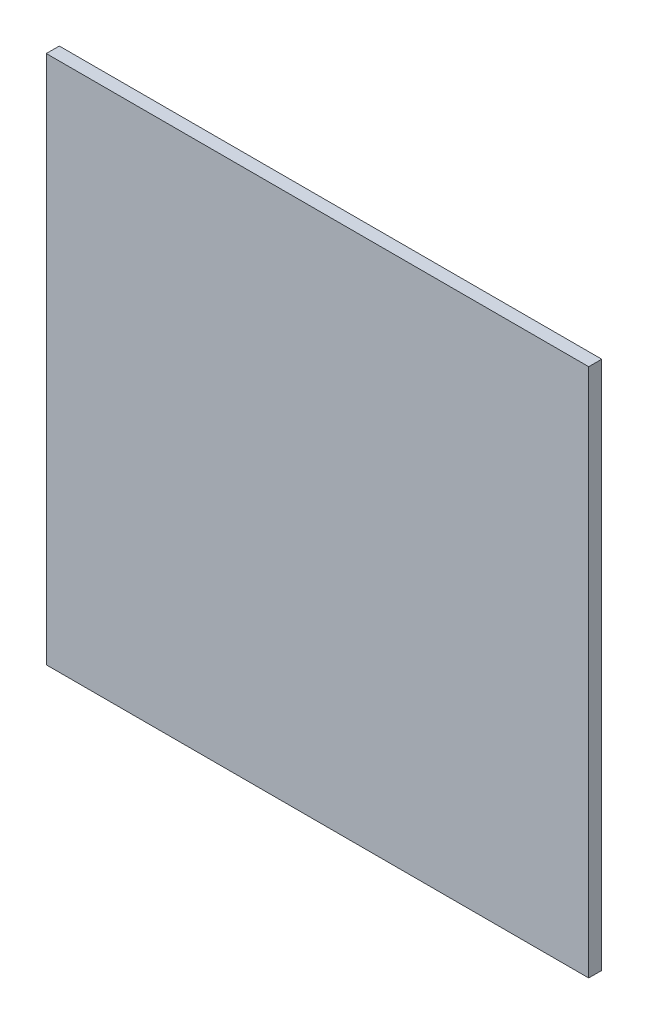
ISO-10303-21;
HEADER;
FILE_DESCRIPTION(('STEP AP214'),'2;1');
FILE_NAME('part.step','',(''),(''),'','','');
FILE_SCHEMA(('AUTOMOTIVE_DESIGN { 1 0 10303 214 1 1 1 1 }'));
ENDSEC;
DATA;
#1=APPLICATION_CONTEXT('core data for automotive mechanical design processes');
#2=APPLICATION_PROTOCOL_DEFINITION('international standard','automotive_design',2000,#1);
#3=PRODUCT_CONTEXT('',#1,'mechanical');
#4=PRODUCT('Part','Part','',(#3));
#5=PRODUCT_RELATED_PRODUCT_CATEGORY('part','',(#4));
#6=PRODUCT_DEFINITION_FORMATION('','',#4);
#7=PRODUCT_DEFINITION_CONTEXT('part definition',#1,'design');
#8=PRODUCT_DEFINITION('design','',#6,#7);
#9=PRODUCT_DEFINITION_SHAPE('','',#8);
#10=(LENGTH_UNIT() NAMED_UNIT(*) SI_UNIT(.MILLI.,.METRE.));
#11=(NAMED_UNIT(*) PLANE_ANGLE_UNIT() SI_UNIT($,.RADIAN.));
#12=(NAMED_UNIT(*) SI_UNIT($,.STERADIAN.) SOLID_ANGLE_UNIT());
#13=UNCERTAINTY_MEASURE_WITH_UNIT(LENGTH_MEASURE(1.E-05),#10,'distance_accuracy_value','');
#14=(GEOMETRIC_REPRESENTATION_CONTEXT(3) GLOBAL_UNCERTAINTY_ASSIGNED_CONTEXT((#13)) GLOBAL_UNIT_ASSIGNED_CONTEXT((#10,
#11,#12)) REPRESENTATION_CONTEXT('',''));
#15=CARTESIAN_POINT('',(0.,0.,0.));
#16=DIRECTION('',(0.,0.,1.));
#17=DIRECTION('',(1.,0.,0.));
#18=AXIS2_PLACEMENT_3D('',#15,#16,#17);
#19=CARTESIAN_POINT('',(-99.21875,96.8374999999999,4.7625));
#20=DIRECTION('',(1.,0.,0.));
#21=DIRECTION('',(0.,1.,0.));
#22=AXIS2_PLACEMENT_3D('',#19,#20,#21);
#23=PLANE('',#22);
#24=DIRECTION('',(0.,-1.,0.));
#25=VECTOR('',#24,1.);
#26=CARTESIAN_POINT('',(-99.21875,96.8374999999999,0.));
#27=LINE('',#26,#25);
#28=CARTESIAN_POINT('',(-99.21875,96.8374999999999,0.));
#29=VERTEX_POINT('',#28);
#30=CARTESIAN_POINT('',(-99.21875,-96.8375,0.));
#31=VERTEX_POINT('',#30);
#32=EDGE_CURVE('E103',#29,#31,#27,.T.);
#33=ORIENTED_EDGE('',*,*,#32,.T.);
#34=DIRECTION('',(0.,0.,-1.));
#35=VECTOR('',#34,1.);
#36=CARTESIAN_POINT('',(-99.21875,-96.8375,4.7625));
#37=LINE('',#36,#35);
#38=CARTESIAN_POINT('',(-99.21875,-96.8375,4.7625));
#39=VERTEX_POINT('',#38);
#40=EDGE_CURVE('E11',#39,#31,#37,.T.);
#41=ORIENTED_EDGE('',*,*,#40,.F.);
#42=DIRECTION('',(0.,-1.,0.));
#43=VECTOR('',#42,1.);
#44=CARTESIAN_POINT('',(-99.21875,96.8374999999999,4.7625));
#45=LINE('',#44,#43);
#46=CARTESIAN_POINT('',(-99.21875,96.8374999999999,4.7625));
#47=VERTEX_POINT('',#46);
#48=EDGE_CURVE('E86',#47,#39,#45,.T.);
#49=ORIENTED_EDGE('',*,*,#48,.F.);
#50=DIRECTION('',(0.,0.,-1.));
#51=VECTOR('',#50,1.);
#52=CARTESIAN_POINT('',(-99.21875,96.8374999999999,4.7625));
#53=LINE('',#52,#51);
#54=EDGE_CURVE('E99',#47,#29,#53,.T.);
#55=ORIENTED_EDGE('',*,*,#54,.T.);
#56=EDGE_LOOP('',(#33,#41,#49,#55));
#57=FACE_BOUND('',#56,.T.);
#58=ADVANCED_FACE('F35',(#57),#23,.F.);
#59=CARTESIAN_POINT('',(99.21875,-96.8375,4.7625));
#60=DIRECTION('',(0.,1.,0.));
#61=DIRECTION('',(-1.,0.,0.));
#62=AXIS2_PLACEMENT_3D('',#59,#60,#61);
#63=PLANE('',#62);
#64=DIRECTION('',(1.,0.,0.));
#65=VECTOR('',#64,1.);
#66=CARTESIAN_POINT('',(99.21875,-96.8375,0.));
#67=LINE('',#66,#65);
#68=CARTESIAN_POINT('',(99.21875,-96.8375,0.));
#69=VERTEX_POINT('',#68);
#70=EDGE_CURVE('E91',#31,#69,#67,.T.);
#71=ORIENTED_EDGE('',*,*,#70,.T.);
#72=DIRECTION('',(0.,0.,-1.));
#73=VECTOR('',#72,1.);
#74=CARTESIAN_POINT('',(99.21875,-96.8375,4.7625));
#75=LINE('',#74,#73);
#76=CARTESIAN_POINT('',(99.21875,-96.8375,4.7625));
#77=VERTEX_POINT('',#76);
#78=EDGE_CURVE('E43',#77,#69,#75,.T.);
#79=ORIENTED_EDGE('',*,*,#78,.F.);
#80=DIRECTION('',(1.,0.,0.));
#81=VECTOR('',#80,1.);
#82=CARTESIAN_POINT('',(99.21875,-96.8375,4.7625));
#83=LINE('',#82,#81);
#84=EDGE_CURVE('E81',#39,#77,#83,.T.);
#85=ORIENTED_EDGE('',*,*,#84,.F.);
#86=ORIENTED_EDGE('',*,*,#40,.T.);
#87=EDGE_LOOP('',(#71,#79,#85,#86));
#88=FACE_BOUND('',#87,.T.);
#89=ADVANCED_FACE('F90',(#88),#63,.F.);
#90=CARTESIAN_POINT('',(99.21875,96.8375,4.7625));
#91=DIRECTION('',(-1.,0.,0.));
#92=DIRECTION('',(0.,-1.,0.));
#93=AXIS2_PLACEMENT_3D('',#90,#91,#92);
#94=PLANE('',#93);
#95=DIRECTION('',(0.,1.,0.));
#96=VECTOR('',#95,1.);
#97=CARTESIAN_POINT('',(99.21875,96.8375,0.));
#98=LINE('',#97,#96);
#99=CARTESIAN_POINT('',(99.21875,96.8375,0.));
#100=VERTEX_POINT('',#99);
#101=EDGE_CURVE('E68',#69,#100,#98,.T.);
#102=ORIENTED_EDGE('',*,*,#101,.T.);
#103=DIRECTION('',(0.,0.,-1.));
#104=VECTOR('',#103,1.);
#105=CARTESIAN_POINT('',(99.21875,96.8375,4.7625));
#106=LINE('',#105,#104);
#107=CARTESIAN_POINT('',(99.21875,96.8375,4.7625));
#108=VERTEX_POINT('',#107);
#109=EDGE_CURVE('E92',#108,#100,#106,.T.);
#110=ORIENTED_EDGE('',*,*,#109,.F.);
#111=DIRECTION('',(0.,1.,0.));
#112=VECTOR('',#111,1.);
#113=CARTESIAN_POINT('',(99.21875,96.8375,4.7625));
#114=LINE('',#113,#112);
#115=EDGE_CURVE('E84',#77,#108,#114,.T.);
#116=ORIENTED_EDGE('',*,*,#115,.F.);
#117=ORIENTED_EDGE('',*,*,#78,.T.);
#118=EDGE_LOOP('',(#102,#110,#116,#117));
#119=FACE_BOUND('',#118,.T.);
#120=ADVANCED_FACE('F93',(#119),#94,.F.);
#121=CARTESIAN_POINT('',(99.21875,96.8375,4.7625));
#122=DIRECTION('',(0.,-1.,0.));
#123=DIRECTION('',(1.,0.,0.));
#124=AXIS2_PLACEMENT_3D('',#121,#122,#123);
#125=PLANE('',#124);
#126=DIRECTION('',(-1.,0.,0.));
#127=VECTOR('',#126,1.);
#128=CARTESIAN_POINT('',(99.21875,96.8375,0.));
#129=LINE('',#128,#127);
#130=EDGE_CURVE('E74',#100,#29,#129,.T.);
#131=ORIENTED_EDGE('',*,*,#130,.T.);
#132=ORIENTED_EDGE('',*,*,#54,.F.);
#133=DIRECTION('',(-1.,0.,0.));
#134=VECTOR('',#133,1.);
#135=CARTESIAN_POINT('',(99.21875,96.8375,4.7625));
#136=LINE('',#135,#134);
#137=EDGE_CURVE('E51',#108,#47,#136,.T.);
#138=ORIENTED_EDGE('',*,*,#137,.F.);
#139=ORIENTED_EDGE('',*,*,#109,.T.);
#140=EDGE_LOOP('',(#131,#132,#138,#139));
#141=FACE_BOUND('',#140,.T.);
#142=ADVANCED_FACE('F112',(#141),#125,.F.);
#143=CARTESIAN_POINT('',(-99.21875,-96.8375,4.7625));
#144=DIRECTION('',(0.,0.,-1.));
#145=DIRECTION('',(-1.,0.,0.));
#146=AXIS2_PLACEMENT_3D('',#143,#144,#145);
#147=PLANE('',#146);
#148=ORIENTED_EDGE('',*,*,#48,.T.);
#149=ORIENTED_EDGE('',*,*,#84,.T.);
#150=ORIENTED_EDGE('',*,*,#115,.T.);
#151=ORIENTED_EDGE('',*,*,#137,.T.);
#152=EDGE_LOOP('',(#148,#149,#150,#151));
#153=FACE_BOUND('',#152,.T.);
#154=ADVANCED_FACE('F82',(#153),#147,.F.);
#155=CARTESIAN_POINT('',(-99.21875,-96.8375,0.));
#156=DIRECTION('',(0.,0.,-1.));
#157=DIRECTION('',(-1.,0.,0.));
#158=AXIS2_PLACEMENT_3D('',#155,#156,#157);
#159=PLANE('',#158);
#160=ORIENTED_EDGE('',*,*,#32,.F.);
#161=ORIENTED_EDGE('',*,*,#130,.F.);
#162=ORIENTED_EDGE('',*,*,#101,.F.);
#163=ORIENTED_EDGE('',*,*,#70,.F.);
#164=EDGE_LOOP('',(#160,#161,#162,#163));
#165=FACE_BOUND('',#164,.T.);
#166=ADVANCED_FACE('F115',(#165),#159,.T.);
#167=CLOSED_SHELL('',(#58,#89,#120,#142,#154,#166));
#168=MANIFOLD_SOLID_BREP('B2',#167);
#169=ADVANCED_BREP_SHAPE_REPRESENTATION('',(#18,#168),#14);
#170=SHAPE_DEFINITION_REPRESENTATION(#9,#169);
ENDSEC;
END-ISO-10303-21;
